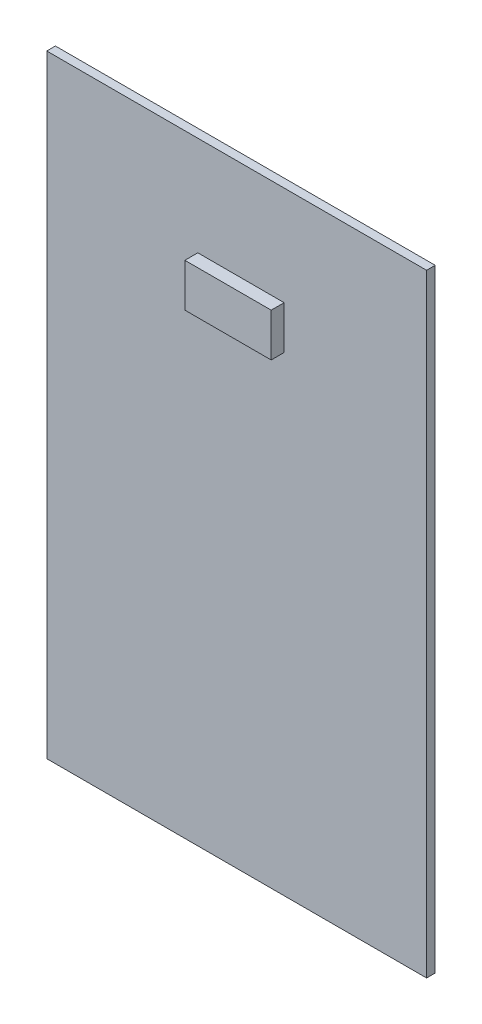
ISO-10303-21;
HEADER;
FILE_DESCRIPTION(('STEP AP214'),'2;1');
FILE_NAME('part.step','',(''),(''),'','','');
FILE_SCHEMA(('AUTOMOTIVE_DESIGN { 1 0 10303 214 1 1 1 1 }'));
ENDSEC;
DATA;
#1=APPLICATION_CONTEXT('core data for automotive mechanical design processes');
#2=APPLICATION_PROTOCOL_DEFINITION('international standard','automotive_design',2000,#1);
#3=PRODUCT_CONTEXT('',#1,'mechanical');
#4=PRODUCT('Part','Part','',(#3));
#5=PRODUCT_RELATED_PRODUCT_CATEGORY('part','',(#4));
#6=PRODUCT_DEFINITION_FORMATION('','',#4);
#7=PRODUCT_DEFINITION_CONTEXT('part definition',#1,'design');
#8=PRODUCT_DEFINITION('design','',#6,#7);
#9=PRODUCT_DEFINITION_SHAPE('','',#8);
#10=(LENGTH_UNIT() NAMED_UNIT(*) SI_UNIT(.MILLI.,.METRE.));
#11=(NAMED_UNIT(*) PLANE_ANGLE_UNIT() SI_UNIT($,.RADIAN.));
#12=(NAMED_UNIT(*) SI_UNIT($,.STERADIAN.) SOLID_ANGLE_UNIT());
#13=UNCERTAINTY_MEASURE_WITH_UNIT(LENGTH_MEASURE(1.E-05),#10,'distance_accuracy_value','');
#14=(GEOMETRIC_REPRESENTATION_CONTEXT(3) GLOBAL_UNCERTAINTY_ASSIGNED_CONTEXT((#13)) GLOBAL_UNIT_ASSIGNED_CONTEXT((#10,
#11,#12)) REPRESENTATION_CONTEXT('',''));
#15=CARTESIAN_POINT('',(0.,0.,0.));
#16=DIRECTION('',(0.,0.,1.));
#17=DIRECTION('',(1.,0.,0.));
#18=AXIS2_PLACEMENT_3D('',#15,#16,#17);
#19=CARTESIAN_POINT('',(0.,0.,2.));
#20=DIRECTION('',(0.,0.,1.));
#21=DIRECTION('',(1.,0.,0.));
#22=AXIS2_PLACEMENT_3D('',#19,#20,#21);
#23=PLANE('',#22);
#24=DIRECTION('',(0.,1.,0.));
#25=VECTOR('',#24,1.);
#26=CARTESIAN_POINT('',(44.,71.,2.));
#27=LINE('',#26,#25);
#28=CARTESIAN_POINT('',(44.,-71.,2.));
#29=VERTEX_POINT('',#28);
#30=CARTESIAN_POINT('',(44.,71.,2.));
#31=VERTEX_POINT('',#30);
#32=EDGE_CURVE('E152',#29,#31,#27,.T.);
#33=ORIENTED_EDGE('',*,*,#32,.T.);
#34=DIRECTION('',(-1.,0.,0.));
#35=VECTOR('',#34,1.);
#36=CARTESIAN_POINT('',(-44.,71.,2.));
#37=LINE('',#36,#35);
#38=CARTESIAN_POINT('',(-44.,71.,2.));
#39=VERTEX_POINT('',#38);
#40=EDGE_CURVE('E92',#31,#39,#37,.T.);
#41=ORIENTED_EDGE('',*,*,#40,.T.);
#42=DIRECTION('',(0.,-1.,0.));
#43=VECTOR('',#42,1.);
#44=CARTESIAN_POINT('',(-44.,71.,2.));
#45=LINE('',#44,#43);
#46=CARTESIAN_POINT('',(-44.,-71.,2.));
#47=VERTEX_POINT('',#46);
#48=EDGE_CURVE('E157',#39,#47,#45,.T.);
#49=ORIENTED_EDGE('',*,*,#48,.T.);
#50=DIRECTION('',(1.,0.,0.));
#51=VECTOR('',#50,1.);
#52=CARTESIAN_POINT('',(-44.,-71.,2.));
#53=LINE('',#52,#51);
#54=EDGE_CURVE('E64',#47,#29,#53,.T.);
#55=ORIENTED_EDGE('',*,*,#54,.T.);
#56=EDGE_LOOP('',(#33,#41,#49,#55));
#57=FACE_BOUND('',#56,.T.);
#58=DIRECTION('',(-1.,0.,0.));
#59=VECTOR('',#58,1.);
#60=CARTESIAN_POINT('',(-9.0047171519716,48.,2.));
#61=LINE('',#60,#59);
#62=CARTESIAN_POINT('',(10.9952828480284,48.,2.));
#63=VERTEX_POINT('',#62);
#64=CARTESIAN_POINT('',(-9.0047171519716,48.,2.));
#65=VERTEX_POINT('',#64);
#66=EDGE_CURVE('E287',#63,#65,#61,.T.);
#67=ORIENTED_EDGE('',*,*,#66,.F.);
#68=DIRECTION('',(0.,1.,0.));
#69=VECTOR('',#68,1.);
#70=CARTESIAN_POINT('',(10.9952828480284,48.,2.));
#71=LINE('',#70,#69);
#72=CARTESIAN_POINT('',(10.9952828480284,38.,2.));
#73=VERTEX_POINT('',#72);
#74=EDGE_CURVE('E139',#73,#63,#71,.T.);
#75=ORIENTED_EDGE('',*,*,#74,.F.);
#76=DIRECTION('',(1.,0.,0.));
#77=VECTOR('',#76,1.);
#78=CARTESIAN_POINT('',(-9.0047171519716,38.,2.));
#79=LINE('',#78,#77);
#80=CARTESIAN_POINT('',(-9.0047171519716,38.,2.));
#81=VERTEX_POINT('',#80);
#82=EDGE_CURVE('E135',#81,#73,#79,.T.);
#83=ORIENTED_EDGE('',*,*,#82,.F.);
#84=DIRECTION('',(0.,-1.,0.));
#85=VECTOR('',#84,1.);
#86=CARTESIAN_POINT('',(-9.0047171519716,48.,2.));
#87=LINE('',#86,#85);
#88=EDGE_CURVE('E283',#65,#81,#87,.T.);
#89=ORIENTED_EDGE('',*,*,#88,.F.);
#90=EDGE_LOOP('',(#67,#75,#83,#89));
#91=FACE_BOUND('',#90,.T.);
#92=ADVANCED_FACE('F39',(#57,#91),#23,.T.);
#93=CARTESIAN_POINT('',(44.,71.,2.));
#94=DIRECTION('',(-1.,0.,0.));
#95=DIRECTION('',(0.,-1.,0.));
#96=AXIS2_PLACEMENT_3D('',#93,#94,#95);
#97=PLANE('',#96);
#98=DIRECTION('',(0.,1.,0.));
#99=VECTOR('',#98,1.);
#100=CARTESIAN_POINT('',(44.,71.,0.));
#101=LINE('',#100,#99);
#102=CARTESIAN_POINT('',(44.,-71.,0.));
#103=VERTEX_POINT('',#102);
#104=CARTESIAN_POINT('',(44.,71.,0.));
#105=VERTEX_POINT('',#104);
#106=EDGE_CURVE('E142',#103,#105,#101,.T.);
#107=ORIENTED_EDGE('',*,*,#106,.T.);
#108=DIRECTION('',(0.,0.,-1.));
#109=VECTOR('',#108,1.);
#110=CARTESIAN_POINT('',(44.,71.,2.));
#111=LINE('',#110,#109);
#112=EDGE_CURVE('E11',#31,#105,#111,.T.);
#113=ORIENTED_EDGE('',*,*,#112,.F.);
#114=ORIENTED_EDGE('',*,*,#32,.F.);
#115=DIRECTION('',(0.,0.,-1.));
#116=VECTOR('',#115,1.);
#117=CARTESIAN_POINT('',(44.,-71.,2.));
#118=LINE('',#117,#116);
#119=EDGE_CURVE('E161',#29,#103,#118,.T.);
#120=ORIENTED_EDGE('',*,*,#119,.T.);
#121=EDGE_LOOP('',(#107,#113,#114,#120));
#122=FACE_BOUND('',#121,.T.);
#123=ADVANCED_FACE('F41',(#122),#97,.F.);
#124=CARTESIAN_POINT('',(-44.,71.,2.));
#125=DIRECTION('',(0.,-1.,0.));
#126=DIRECTION('',(0.,0.,-1.));
#127=AXIS2_PLACEMENT_3D('',#124,#125,#126);
#128=PLANE('',#127);
#129=DIRECTION('',(-1.,0.,0.));
#130=VECTOR('',#129,1.);
#131=CARTESIAN_POINT('',(-44.,71.,0.));
#132=LINE('',#131,#130);
#133=CARTESIAN_POINT('',(-44.,71.,0.));
#134=VERTEX_POINT('',#133);
#135=EDGE_CURVE('E147',#105,#134,#132,.T.);
#136=ORIENTED_EDGE('',*,*,#135,.T.);
#137=DIRECTION('',(0.,0.,-1.));
#138=VECTOR('',#137,1.);
#139=CARTESIAN_POINT('',(-44.,71.,2.));
#140=LINE('',#139,#138);
#141=EDGE_CURVE('E48',#39,#134,#140,.T.);
#142=ORIENTED_EDGE('',*,*,#141,.F.);
#143=ORIENTED_EDGE('',*,*,#40,.F.);
#144=ORIENTED_EDGE('',*,*,#112,.T.);
#145=EDGE_LOOP('',(#136,#142,#143,#144));
#146=FACE_BOUND('',#145,.T.);
#147=ADVANCED_FACE('F195',(#146),#128,.F.);
#148=CARTESIAN_POINT('',(-44.,71.,2.));
#149=DIRECTION('',(1.,0.,0.));
#150=DIRECTION('',(0.,1.,0.));
#151=AXIS2_PLACEMENT_3D('',#148,#149,#150);
#152=PLANE('',#151);
#153=DIRECTION('',(0.,-1.,0.));
#154=VECTOR('',#153,1.);
#155=CARTESIAN_POINT('',(-44.,71.,0.));
#156=LINE('',#155,#154);
#157=CARTESIAN_POINT('',(-44.,-71.,0.));
#158=VERTEX_POINT('',#157);
#159=EDGE_CURVE('E165',#134,#158,#156,.T.);
#160=ORIENTED_EDGE('',*,*,#159,.T.);
#161=DIRECTION('',(0.,0.,-1.));
#162=VECTOR('',#161,1.);
#163=CARTESIAN_POINT('',(-44.,-71.,2.));
#164=LINE('',#163,#162);
#165=EDGE_CURVE('E172',#47,#158,#164,.T.);
#166=ORIENTED_EDGE('',*,*,#165,.F.);
#167=ORIENTED_EDGE('',*,*,#48,.F.);
#168=ORIENTED_EDGE('',*,*,#141,.T.);
#169=EDGE_LOOP('',(#160,#166,#167,#168));
#170=FACE_BOUND('',#169,.T.);
#171=ADVANCED_FACE('F179',(#170),#152,.F.);
#172=CARTESIAN_POINT('',(-44.,-71.,2.));
#173=DIRECTION('',(0.,1.,0.));
#174=DIRECTION('',(0.,0.,1.));
#175=AXIS2_PLACEMENT_3D('',#172,#173,#174);
#176=PLANE('',#175);
#177=DIRECTION('',(1.,0.,0.));
#178=VECTOR('',#177,1.);
#179=CARTESIAN_POINT('',(-44.,-71.,0.));
#180=LINE('',#179,#178);
#181=EDGE_CURVE('E85',#158,#103,#180,.T.);
#182=ORIENTED_EDGE('',*,*,#181,.T.);
#183=ORIENTED_EDGE('',*,*,#119,.F.);
#184=ORIENTED_EDGE('',*,*,#54,.F.);
#185=ORIENTED_EDGE('',*,*,#165,.T.);
#186=EDGE_LOOP('',(#182,#183,#184,#185));
#187=FACE_BOUND('',#186,.T.);
#188=ADVANCED_FACE('F187',(#187),#176,.F.);
#189=CARTESIAN_POINT('',(0.,0.,0.));
#190=DIRECTION('',(0.,0.,1.));
#191=DIRECTION('',(1.,0.,0.));
#192=AXIS2_PLACEMENT_3D('',#189,#190,#191);
#193=PLANE('',#192);
#194=ORIENTED_EDGE('',*,*,#106,.F.);
#195=ORIENTED_EDGE('',*,*,#181,.F.);
#196=ORIENTED_EDGE('',*,*,#159,.F.);
#197=ORIENTED_EDGE('',*,*,#135,.F.);
#198=EDGE_LOOP('',(#194,#195,#196,#197));
#199=FACE_BOUND('',#198,.T.);
#200=ADVANCED_FACE('F183',(#199),#193,.F.);
#201=CARTESIAN_POINT('',(10.9952828480284,48.,5.));
#202=DIRECTION('',(-1.,0.,0.));
#203=DIRECTION('',(0.,0.,1.));
#204=AXIS2_PLACEMENT_3D('',#201,#202,#203);
#205=PLANE('',#204);
#206=ORIENTED_EDGE('',*,*,#74,.T.);
#207=DIRECTION('',(0.,0.,-1.));
#208=VECTOR('',#207,1.);
#209=CARTESIAN_POINT('',(10.9952828480284,48.,5.));
#210=LINE('',#209,#208);
#211=CARTESIAN_POINT('',(10.9952828480284,48.,5.));
#212=VERTEX_POINT('',#211);
#213=EDGE_CURVE('E118',#212,#63,#210,.T.);
#214=ORIENTED_EDGE('',*,*,#213,.F.);
#215=DIRECTION('',(0.,1.,0.));
#216=VECTOR('',#215,1.);
#217=CARTESIAN_POINT('',(10.9952828480284,48.,5.));
#218=LINE('',#217,#216);
#219=CARTESIAN_POINT('',(10.9952828480284,38.,5.));
#220=VERTEX_POINT('',#219);
#221=EDGE_CURVE('E126',#220,#212,#218,.T.);
#222=ORIENTED_EDGE('',*,*,#221,.F.);
#223=DIRECTION('',(0.,0.,-1.));
#224=VECTOR('',#223,1.);
#225=CARTESIAN_POINT('',(10.9952828480284,38.,5.));
#226=LINE('',#225,#224);
#227=EDGE_CURVE('E280',#220,#73,#226,.T.);
#228=ORIENTED_EDGE('',*,*,#227,.T.);
#229=EDGE_LOOP('',(#206,#214,#222,#228));
#230=FACE_BOUND('',#229,.T.);
#231=ADVANCED_FACE('F137',(#230),#205,.F.);
#232=CARTESIAN_POINT('',(-9.0047171519716,48.,5.));
#233=DIRECTION('',(0.,-1.,0.));
#234=DIRECTION('',(0.,0.,-1.));
#235=AXIS2_PLACEMENT_3D('',#232,#233,#234);
#236=PLANE('',#235);
#237=ORIENTED_EDGE('',*,*,#66,.T.);
#238=DIRECTION('',(0.,0.,-1.));
#239=VECTOR('',#238,1.);
#240=CARTESIAN_POINT('',(-9.0047171519716,48.,5.));
#241=LINE('',#240,#239);
#242=CARTESIAN_POINT('',(-9.0047171519716,48.,5.));
#243=VERTEX_POINT('',#242);
#244=EDGE_CURVE('E121',#243,#65,#241,.T.);
#245=ORIENTED_EDGE('',*,*,#244,.F.);
#246=DIRECTION('',(-1.,0.,0.));
#247=VECTOR('',#246,1.);
#248=CARTESIAN_POINT('',(-9.0047171519716,48.,5.));
#249=LINE('',#248,#247);
#250=EDGE_CURVE('E114',#212,#243,#249,.T.);
#251=ORIENTED_EDGE('',*,*,#250,.F.);
#252=ORIENTED_EDGE('',*,*,#213,.T.);
#253=EDGE_LOOP('',(#237,#245,#251,#252));
#254=FACE_BOUND('',#253,.T.);
#255=ADVANCED_FACE('F116',(#254),#236,.F.);
#256=CARTESIAN_POINT('',(-9.0047171519716,48.,5.));
#257=DIRECTION('',(1.,0.,0.));
#258=DIRECTION('',(0.,1.,0.));
#259=AXIS2_PLACEMENT_3D('',#256,#257,#258);
#260=PLANE('',#259);
#261=ORIENTED_EDGE('',*,*,#88,.T.);
#262=DIRECTION('',(0.,0.,-1.));
#263=VECTOR('',#262,1.);
#264=CARTESIAN_POINT('',(-9.0047171519716,38.,5.));
#265=LINE('',#264,#263);
#266=CARTESIAN_POINT('',(-9.0047171519716,38.,5.));
#267=VERTEX_POINT('',#266);
#268=EDGE_CURVE('E55',#267,#81,#265,.T.);
#269=ORIENTED_EDGE('',*,*,#268,.F.);
#270=DIRECTION('',(0.,-1.,0.));
#271=VECTOR('',#270,1.);
#272=CARTESIAN_POINT('',(-9.0047171519716,48.,5.));
#273=LINE('',#272,#271);
#274=EDGE_CURVE('E125',#243,#267,#273,.T.);
#275=ORIENTED_EDGE('',*,*,#274,.F.);
#276=ORIENTED_EDGE('',*,*,#244,.T.);
#277=EDGE_LOOP('',(#261,#269,#275,#276));
#278=FACE_BOUND('',#277,.T.);
#279=ADVANCED_FACE('F208',(#278),#260,.F.);
#280=CARTESIAN_POINT('',(-9.0047171519716,38.,5.));
#281=DIRECTION('',(0.,1.,0.));
#282=DIRECTION('',(0.,0.,1.));
#283=AXIS2_PLACEMENT_3D('',#280,#281,#282);
#284=PLANE('',#283);
#285=ORIENTED_EDGE('',*,*,#82,.T.);
#286=ORIENTED_EDGE('',*,*,#227,.F.);
#287=DIRECTION('',(1.,0.,0.));
#288=VECTOR('',#287,1.);
#289=CARTESIAN_POINT('',(-9.0047171519716,38.,5.));
#290=LINE('',#289,#288);
#291=EDGE_CURVE('E130',#267,#220,#290,.T.);
#292=ORIENTED_EDGE('',*,*,#291,.F.);
#293=ORIENTED_EDGE('',*,*,#268,.T.);
#294=EDGE_LOOP('',(#285,#286,#292,#293));
#295=FACE_BOUND('',#294,.T.);
#296=ADVANCED_FACE('F211',(#295),#284,.F.);
#297=CARTESIAN_POINT('',(0.,0.,5.));
#298=DIRECTION('',(0.,0.,1.));
#299=DIRECTION('',(1.,0.,0.));
#300=AXIS2_PLACEMENT_3D('',#297,#298,#299);
#301=PLANE('',#300);
#302=ORIENTED_EDGE('',*,*,#221,.T.);
#303=ORIENTED_EDGE('',*,*,#250,.T.);
#304=ORIENTED_EDGE('',*,*,#274,.T.);
#305=ORIENTED_EDGE('',*,*,#291,.T.);
#306=EDGE_LOOP('',(#302,#303,#304,#305));
#307=FACE_BOUND('',#306,.T.);
#308=ADVANCED_FACE('F129',(#307),#301,.T.);
#309=CLOSED_SHELL('',(#92,#123,#147,#171,#188,#200,#231,#255,#279,#296,#308));
#310=MANIFOLD_SOLID_BREP('B2',#309);
#311=ADVANCED_BREP_SHAPE_REPRESENTATION('',(#18,#310),#14);
#312=SHAPE_DEFINITION_REPRESENTATION(#9,#311);
ENDSEC;
END-ISO-10303-21;
